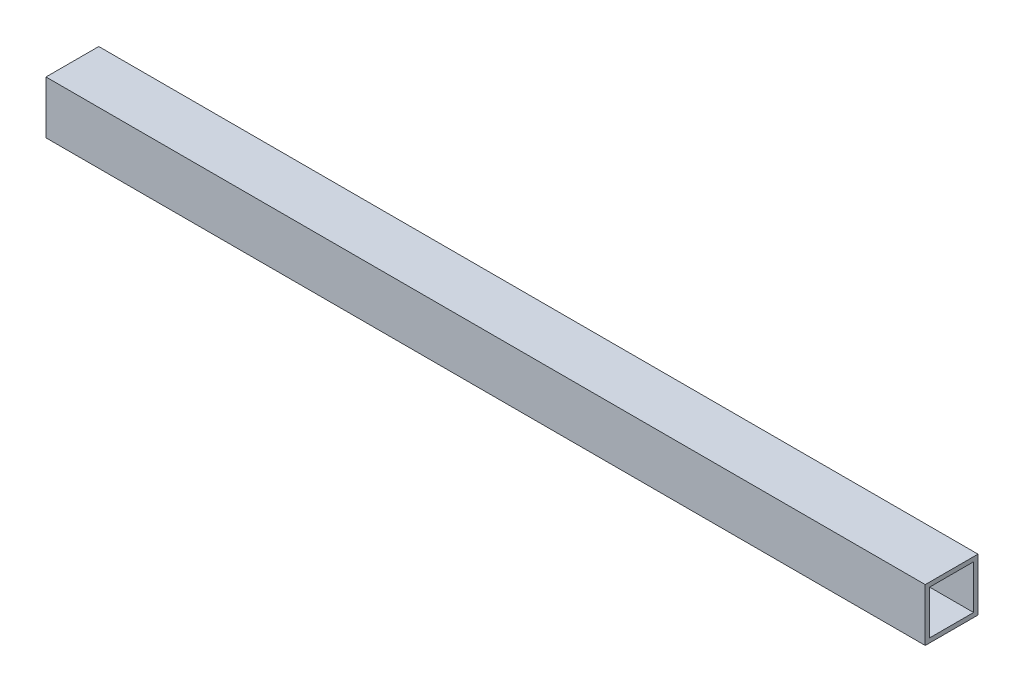
ISO-10303-21;
HEADER;
FILE_DESCRIPTION(('STEP AP214'),'2;1');
FILE_NAME('part.step','',(''),(''),'','','');
FILE_SCHEMA(('AUTOMOTIVE_DESIGN { 1 0 10303 214 1 1 1 1 }'));
ENDSEC;
DATA;
#1=APPLICATION_CONTEXT('core data for automotive mechanical design processes');
#2=APPLICATION_PROTOCOL_DEFINITION('international standard','automotive_design',2000,#1);
#3=PRODUCT_CONTEXT('',#1,'mechanical');
#4=PRODUCT('Part','Part','',(#3));
#5=PRODUCT_RELATED_PRODUCT_CATEGORY('part','',(#4));
#6=PRODUCT_DEFINITION_FORMATION('','',#4);
#7=PRODUCT_DEFINITION_CONTEXT('part definition',#1,'design');
#8=PRODUCT_DEFINITION('design','',#6,#7);
#9=PRODUCT_DEFINITION_SHAPE('','',#8);
#10=(LENGTH_UNIT() NAMED_UNIT(*) SI_UNIT(.MILLI.,.METRE.));
#11=(NAMED_UNIT(*) PLANE_ANGLE_UNIT() SI_UNIT($,.RADIAN.));
#12=(NAMED_UNIT(*) SI_UNIT($,.STERADIAN.) SOLID_ANGLE_UNIT());
#13=UNCERTAINTY_MEASURE_WITH_UNIT(LENGTH_MEASURE(1.E-05),#10,'distance_accuracy_value','');
#14=(GEOMETRIC_REPRESENTATION_CONTEXT(3) GLOBAL_UNCERTAINTY_ASSIGNED_CONTEXT((#13)) GLOBAL_UNIT_ASSIGNED_CONTEXT((#10,
#11,#12)) REPRESENTATION_CONTEXT('',''));
#15=CARTESIAN_POINT('',(0.,0.,0.));
#16=DIRECTION('',(0.,0.,1.));
#17=DIRECTION('',(1.,0.,0.));
#18=AXIS2_PLACEMENT_3D('',#15,#16,#17);
#19=CARTESIAN_POINT('',(-317.5,-19.05,19.05));
#20=DIRECTION('',(0.,-1.,0.));
#21=DIRECTION('',(0.,0.,-1.));
#22=AXIS2_PLACEMENT_3D('',#19,#20,#21);
#23=PLANE('',#22);
#24=DIRECTION('',(1.,0.,0.));
#25=VECTOR('',#24,1.);
#26=CARTESIAN_POINT('',(-317.5,-19.05,19.05));
#27=LINE('',#26,#25);
#28=CARTESIAN_POINT('',(-317.5,-19.05,19.05));
#29=VERTEX_POINT('',#28);
#30=CARTESIAN_POINT('',(317.5,-19.05,19.05));
#31=VERTEX_POINT('',#30);
#32=EDGE_CURVE('E114',#29,#31,#27,.T.);
#33=ORIENTED_EDGE('',*,*,#32,.F.);
#34=DIRECTION('',(0.,0.,-1.));
#35=VECTOR('',#34,1.);
#36=CARTESIAN_POINT('',(-317.5,-19.05,0.));
#37=LINE('',#36,#35);
#38=CARTESIAN_POINT('',(-317.5,-19.05,-19.05));
#39=VERTEX_POINT('',#38);
#40=EDGE_CURVE('E136',#29,#39,#37,.T.);
#41=ORIENTED_EDGE('',*,*,#40,.T.);
#42=DIRECTION('',(-1.,0.,0.));
#43=VECTOR('',#42,1.);
#44=CARTESIAN_POINT('',(-317.5,-19.05,-19.05));
#45=LINE('',#44,#43);
#46=CARTESIAN_POINT('',(317.5,-19.05,-19.05));
#47=VERTEX_POINT('',#46);
#48=EDGE_CURVE('E131',#47,#39,#45,.T.);
#49=ORIENTED_EDGE('',*,*,#48,.F.);
#50=DIRECTION('',(0.,0.,-1.));
#51=VECTOR('',#50,1.);
#52=CARTESIAN_POINT('',(317.5,-19.05,0.));
#53=LINE('',#52,#51);
#54=EDGE_CURVE('E106',#31,#47,#53,.T.);
#55=ORIENTED_EDGE('',*,*,#54,.F.);
#56=EDGE_LOOP('',(#33,#41,#49,#55));
#57=FACE_BOUND('',#56,.T.);
#58=ADVANCED_FACE('F17',(#57),#23,.T.);
#59=CARTESIAN_POINT('',(-317.5,15.875,-15.875));
#60=DIRECTION('',(0.,0.,1.));
#61=DIRECTION('',(1.,0.,0.));
#62=AXIS2_PLACEMENT_3D('',#59,#60,#61);
#63=PLANE('',#62);
#64=DIRECTION('',(1.,0.,0.));
#65=VECTOR('',#64,1.);
#66=CARTESIAN_POINT('',(-317.5,15.875,-15.875));
#67=LINE('',#66,#65);
#68=CARTESIAN_POINT('',(-317.5,15.875,-15.875));
#69=VERTEX_POINT('',#68);
#70=CARTESIAN_POINT('',(317.5,15.875,-15.875));
#71=VERTEX_POINT('',#70);
#72=EDGE_CURVE('E91',#69,#71,#67,.T.);
#73=ORIENTED_EDGE('',*,*,#72,.F.);
#74=DIRECTION('',(0.,1.,0.));
#75=VECTOR('',#74,1.);
#76=CARTESIAN_POINT('',(-317.5,0.,-15.875));
#77=LINE('',#76,#75);
#78=CARTESIAN_POINT('',(-317.5,-15.875,-15.875));
#79=VERTEX_POINT('',#78);
#80=EDGE_CURVE('E139',#69,#79,#77,.F.);
#81=ORIENTED_EDGE('',*,*,#80,.T.);
#82=DIRECTION('',(1.,0.,0.));
#83=VECTOR('',#82,1.);
#84=CARTESIAN_POINT('',(-317.5,-15.875,-15.875));
#85=LINE('',#84,#83);
#86=CARTESIAN_POINT('',(317.5,-15.875,-15.875));
#87=VERTEX_POINT('',#86);
#88=EDGE_CURVE('E20',#87,#79,#85,.F.);
#89=ORIENTED_EDGE('',*,*,#88,.F.);
#90=DIRECTION('',(0.,1.,0.));
#91=VECTOR('',#90,1.);
#92=CARTESIAN_POINT('',(317.5,0.,-15.875));
#93=LINE('',#92,#91);
#94=EDGE_CURVE('E105',#71,#87,#93,.F.);
#95=ORIENTED_EDGE('',*,*,#94,.F.);
#96=EDGE_LOOP('',(#73,#81,#89,#95));
#97=FACE_BOUND('',#96,.T.);
#98=ADVANCED_FACE('F125',(#97),#63,.T.);
#99=CARTESIAN_POINT('',(-317.5,-15.875,-15.875));
#100=DIRECTION('',(0.,1.,0.));
#101=DIRECTION('',(0.,0.,1.));
#102=AXIS2_PLACEMENT_3D('',#99,#100,#101);
#103=PLANE('',#102);
#104=ORIENTED_EDGE('',*,*,#88,.T.);
#105=DIRECTION('',(0.,0.,-1.));
#106=VECTOR('',#105,1.);
#107=CARTESIAN_POINT('',(-317.5,-15.875,0.));
#108=LINE('',#107,#106);
#109=CARTESIAN_POINT('',(-317.5,-15.875,15.875));
#110=VERTEX_POINT('',#109);
#111=EDGE_CURVE('E88',#79,#110,#108,.F.);
#112=ORIENTED_EDGE('',*,*,#111,.T.);
#113=DIRECTION('',(-1.,0.,0.));
#114=VECTOR('',#113,1.);
#115=CARTESIAN_POINT('',(-317.5,-15.875,15.875));
#116=LINE('',#115,#114);
#117=CARTESIAN_POINT('',(317.5,-15.875,15.875));
#118=VERTEX_POINT('',#117);
#119=EDGE_CURVE('E80',#118,#110,#116,.T.);
#120=ORIENTED_EDGE('',*,*,#119,.F.);
#121=DIRECTION('',(0.,0.,-1.));
#122=VECTOR('',#121,1.);
#123=CARTESIAN_POINT('',(317.5,-15.875,0.));
#124=LINE('',#123,#122);
#125=EDGE_CURVE('E85',#87,#118,#124,.F.);
#126=ORIENTED_EDGE('',*,*,#125,.F.);
#127=EDGE_LOOP('',(#104,#112,#120,#126));
#128=FACE_BOUND('',#127,.T.);
#129=ADVANCED_FACE('F83',(#128),#103,.T.);
#130=CARTESIAN_POINT('',(-317.5,-15.875,15.875));
#131=DIRECTION('',(0.,0.,-1.));
#132=DIRECTION('',(-1.,0.,0.));
#133=AXIS2_PLACEMENT_3D('',#130,#131,#132);
#134=PLANE('',#133);
#135=ORIENTED_EDGE('',*,*,#119,.T.);
#136=DIRECTION('',(0.,1.,0.));
#137=VECTOR('',#136,1.);
#138=CARTESIAN_POINT('',(-317.5,0.,15.875));
#139=LINE('',#138,#137);
#140=CARTESIAN_POINT('',(-317.5,15.875,15.875));
#141=VERTEX_POINT('',#140);
#142=EDGE_CURVE('E142',#110,#141,#139,.T.);
#143=ORIENTED_EDGE('',*,*,#142,.T.);
#144=DIRECTION('',(1.,0.,0.));
#145=VECTOR('',#144,1.);
#146=CARTESIAN_POINT('',(-317.5,15.875,15.875));
#147=LINE('',#146,#145);
#148=CARTESIAN_POINT('',(317.5,15.875,15.875));
#149=VERTEX_POINT('',#148);
#150=EDGE_CURVE('E96',#149,#141,#147,.F.);
#151=ORIENTED_EDGE('',*,*,#150,.F.);
#152=DIRECTION('',(0.,1.,0.));
#153=VECTOR('',#152,1.);
#154=CARTESIAN_POINT('',(317.5,0.,15.875));
#155=LINE('',#154,#153);
#156=EDGE_CURVE('E93',#118,#149,#155,.T.);
#157=ORIENTED_EDGE('',*,*,#156,.F.);
#158=EDGE_LOOP('',(#135,#143,#151,#157));
#159=FACE_BOUND('',#158,.T.);
#160=ADVANCED_FACE('F94',(#159),#134,.T.);
#161=CARTESIAN_POINT('',(-317.5,15.875,15.875));
#162=DIRECTION('',(0.,-1.,0.));
#163=DIRECTION('',(0.,0.,-1.));
#164=AXIS2_PLACEMENT_3D('',#161,#162,#163);
#165=PLANE('',#164);
#166=ORIENTED_EDGE('',*,*,#150,.T.);
#167=DIRECTION('',(0.,0.,-1.));
#168=VECTOR('',#167,1.);
#169=CARTESIAN_POINT('',(-317.5,15.875,0.));
#170=LINE('',#169,#168);
#171=EDGE_CURVE('E122',#141,#69,#170,.T.);
#172=ORIENTED_EDGE('',*,*,#171,.T.);
#173=ORIENTED_EDGE('',*,*,#72,.T.);
#174=DIRECTION('',(0.,0.,-1.));
#175=VECTOR('',#174,1.);
#176=CARTESIAN_POINT('',(317.5,15.875,0.));
#177=LINE('',#176,#175);
#178=EDGE_CURVE('E100',#149,#71,#177,.T.);
#179=ORIENTED_EDGE('',*,*,#178,.F.);
#180=EDGE_LOOP('',(#166,#172,#173,#179));
#181=FACE_BOUND('',#180,.T.);
#182=ADVANCED_FACE('F120',(#181),#165,.T.);
#183=CARTESIAN_POINT('',(-317.5,19.05,19.05));
#184=DIRECTION('',(0.,0.,1.));
#185=DIRECTION('',(1.,0.,0.));
#186=AXIS2_PLACEMENT_3D('',#183,#184,#185);
#187=PLANE('',#186);
#188=DIRECTION('',(1.,0.,0.));
#189=VECTOR('',#188,1.);
#190=CARTESIAN_POINT('',(-317.5,19.05,19.05));
#191=LINE('',#190,#189);
#192=CARTESIAN_POINT('',(-317.5,19.05,19.05));
#193=VERTEX_POINT('',#192);
#194=CARTESIAN_POINT('',(317.5,19.05,19.05));
#195=VERTEX_POINT('',#194);
#196=EDGE_CURVE('E145',#193,#195,#191,.T.);
#197=ORIENTED_EDGE('',*,*,#196,.F.);
#198=DIRECTION('',(0.,1.,0.));
#199=VECTOR('',#198,1.);
#200=CARTESIAN_POINT('',(-317.5,0.,19.05));
#201=LINE('',#200,#199);
#202=EDGE_CURVE('E133',#193,#29,#201,.F.);
#203=ORIENTED_EDGE('',*,*,#202,.T.);
#204=ORIENTED_EDGE('',*,*,#32,.T.);
#205=DIRECTION('',(0.,1.,0.));
#206=VECTOR('',#205,1.);
#207=CARTESIAN_POINT('',(317.5,0.,19.05));
#208=LINE('',#207,#206);
#209=EDGE_CURVE('E108',#195,#31,#208,.F.);
#210=ORIENTED_EDGE('',*,*,#209,.F.);
#211=EDGE_LOOP('',(#197,#203,#204,#210));
#212=FACE_BOUND('',#211,.T.);
#213=ADVANCED_FACE('F164',(#212),#187,.T.);
#214=CARTESIAN_POINT('',(317.5,0.,0.));
#215=DIRECTION('',(1.,0.,0.));
#216=DIRECTION('',(0.,0.,-1.));
#217=AXIS2_PLACEMENT_3D('',#214,#215,#216);
#218=PLANE('',#217);
#219=ORIENTED_EDGE('',*,*,#178,.T.);
#220=ORIENTED_EDGE('',*,*,#94,.T.);
#221=ORIENTED_EDGE('',*,*,#125,.T.);
#222=ORIENTED_EDGE('',*,*,#156,.T.);
#223=EDGE_LOOP('',(#219,#220,#221,#222));
#224=FACE_BOUND('',#223,.T.);
#225=DIRECTION('',(0.,1.,0.));
#226=VECTOR('',#225,1.);
#227=CARTESIAN_POINT('',(317.5,-19.05,-19.05));
#228=LINE('',#227,#226);
#229=CARTESIAN_POINT('',(317.5,19.05,-19.05));
#230=VERTEX_POINT('',#229);
#231=EDGE_CURVE('E126',#230,#47,#228,.F.);
#232=ORIENTED_EDGE('',*,*,#231,.F.);
#233=DIRECTION('',(0.,0.,1.));
#234=VECTOR('',#233,1.);
#235=CARTESIAN_POINT('',(317.5,19.05,-19.05));
#236=LINE('',#235,#234);
#237=EDGE_CURVE('E148',#195,#230,#236,.F.);
#238=ORIENTED_EDGE('',*,*,#237,.F.);
#239=ORIENTED_EDGE('',*,*,#209,.T.);
#240=ORIENTED_EDGE('',*,*,#54,.T.);
#241=EDGE_LOOP('',(#232,#238,#239,#240));
#242=FACE_BOUND('',#241,.T.);
#243=ADVANCED_FACE('F102',(#224,#242),#218,.T.);
#244=CARTESIAN_POINT('',(-317.5,-19.05,-19.05));
#245=DIRECTION('',(0.,0.,-1.));
#246=DIRECTION('',(-1.,0.,0.));
#247=AXIS2_PLACEMENT_3D('',#244,#245,#246);
#248=PLANE('',#247);
#249=ORIENTED_EDGE('',*,*,#48,.T.);
#250=DIRECTION('',(0.,1.,0.));
#251=VECTOR('',#250,1.);
#252=CARTESIAN_POINT('',(-317.5,0.,-19.05));
#253=LINE('',#252,#251);
#254=CARTESIAN_POINT('',(-317.5,19.05,-19.05));
#255=VERTEX_POINT('',#254);
#256=EDGE_CURVE('E35',#39,#255,#253,.T.);
#257=ORIENTED_EDGE('',*,*,#256,.T.);
#258=DIRECTION('',(1.,0.,0.));
#259=VECTOR('',#258,1.);
#260=CARTESIAN_POINT('',(-317.5,19.05,-19.05));
#261=LINE('',#260,#259);
#262=EDGE_CURVE('E26',#230,#255,#261,.F.);
#263=ORIENTED_EDGE('',*,*,#262,.F.);
#264=ORIENTED_EDGE('',*,*,#231,.T.);
#265=EDGE_LOOP('',(#249,#257,#263,#264));
#266=FACE_BOUND('',#265,.T.);
#267=ADVANCED_FACE('F155',(#266),#248,.T.);
#268=CARTESIAN_POINT('',(-317.5,0.,0.));
#269=DIRECTION('',(1.,0.,0.));
#270=DIRECTION('',(0.,0.,-1.));
#271=AXIS2_PLACEMENT_3D('',#268,#269,#270);
#272=PLANE('',#271);
#273=ORIENTED_EDGE('',*,*,#142,.F.);
#274=ORIENTED_EDGE('',*,*,#111,.F.);
#275=ORIENTED_EDGE('',*,*,#80,.F.);
#276=ORIENTED_EDGE('',*,*,#171,.F.);
#277=EDGE_LOOP('',(#273,#274,#275,#276));
#278=FACE_BOUND('',#277,.T.);
#279=ORIENTED_EDGE('',*,*,#40,.F.);
#280=ORIENTED_EDGE('',*,*,#202,.F.);
#281=DIRECTION('',(0.,0.,1.));
#282=VECTOR('',#281,1.);
#283=CARTESIAN_POINT('',(-317.5,19.05,-19.05));
#284=LINE('',#283,#282);
#285=EDGE_CURVE('E11',#255,#193,#284,.T.);
#286=ORIENTED_EDGE('',*,*,#285,.F.);
#287=ORIENTED_EDGE('',*,*,#256,.F.);
#288=EDGE_LOOP('',(#279,#280,#286,#287));
#289=FACE_BOUND('',#288,.T.);
#290=ADVANCED_FACE('F162',(#278,#289),#272,.F.);
#291=CARTESIAN_POINT('',(-317.5,19.05,-19.05));
#292=DIRECTION('',(0.,1.,0.));
#293=DIRECTION('',(0.,0.,1.));
#294=AXIS2_PLACEMENT_3D('',#291,#292,#293);
#295=PLANE('',#294);
#296=ORIENTED_EDGE('',*,*,#262,.T.);
#297=ORIENTED_EDGE('',*,*,#285,.T.);
#298=ORIENTED_EDGE('',*,*,#196,.T.);
#299=ORIENTED_EDGE('',*,*,#237,.T.);
#300=EDGE_LOOP('',(#296,#297,#298,#299));
#301=FACE_BOUND('',#300,.T.);
#302=ADVANCED_FACE('F153',(#301),#295,.T.);
#303=CLOSED_SHELL('',(#58,#98,#129,#160,#182,#213,#243,#267,#290,#302));
#304=MANIFOLD_SOLID_BREP('B1',#303);
#305=ADVANCED_BREP_SHAPE_REPRESENTATION('',(#18,#304),#14);
#306=SHAPE_DEFINITION_REPRESENTATION(#9,#305);
ENDSEC;
END-ISO-10303-21;
